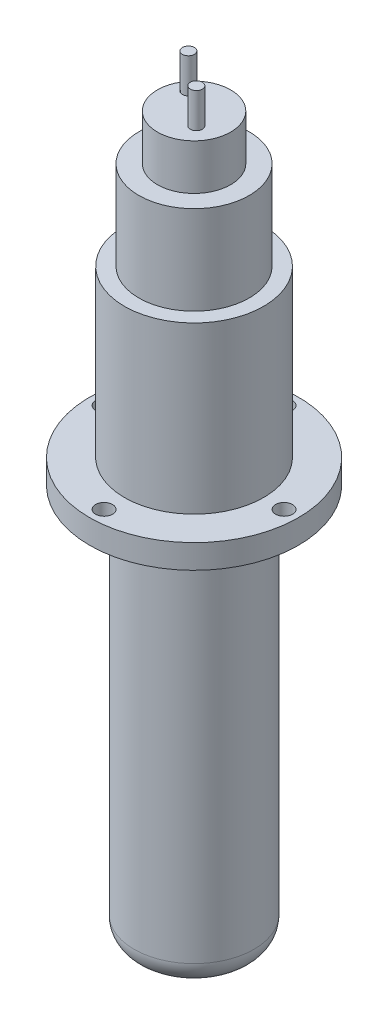
ISO-10303-21;
HEADER;
FILE_DESCRIPTION(('STEP AP214'),'2;1');
FILE_NAME('part.step','',(''),(''),'','','');
FILE_SCHEMA(('AUTOMOTIVE_DESIGN { 1 0 10303 214 1 1 1 1 }'));
ENDSEC;
DATA;
#1=APPLICATION_CONTEXT('core data for automotive mechanical design processes');
#2=APPLICATION_PROTOCOL_DEFINITION('international standard','automotive_design',2000,#1);
#3=PRODUCT_CONTEXT('',#1,'mechanical');
#4=PRODUCT('Part','Part','',(#3));
#5=PRODUCT_RELATED_PRODUCT_CATEGORY('part','',(#4));
#6=PRODUCT_DEFINITION_FORMATION('','',#4);
#7=PRODUCT_DEFINITION_CONTEXT('part definition',#1,'design');
#8=PRODUCT_DEFINITION('design','',#6,#7);
#9=PRODUCT_DEFINITION_SHAPE('','',#8);
#10=(LENGTH_UNIT() NAMED_UNIT(*) SI_UNIT(.MILLI.,.METRE.));
#11=(NAMED_UNIT(*) PLANE_ANGLE_UNIT() SI_UNIT($,.RADIAN.));
#12=(NAMED_UNIT(*) SI_UNIT($,.STERADIAN.) SOLID_ANGLE_UNIT());
#13=UNCERTAINTY_MEASURE_WITH_UNIT(LENGTH_MEASURE(1.E-05),#10,'distance_accuracy_value','');
#14=(GEOMETRIC_REPRESENTATION_CONTEXT(3) GLOBAL_UNCERTAINTY_ASSIGNED_CONTEXT((#13)) GLOBAL_UNIT_ASSIGNED_CONTEXT((#10,
#11,#12)) REPRESENTATION_CONTEXT('',''));
#15=CARTESIAN_POINT('',(0.,0.,0.));
#16=DIRECTION('',(0.,0.,1.));
#17=DIRECTION('',(1.,0.,0.));
#18=AXIS2_PLACEMENT_3D('',#15,#16,#17);
#19=CARTESIAN_POINT('',(0.,5.08,0.));
#20=DIRECTION('',(0.,-1.,0.));
#21=DIRECTION('',(0.,0.,-1.));
#22=AXIS2_PLACEMENT_3D('',#19,#20,#21);
#23=CYLINDRICAL_SURFACE('',#22,22.098);
#24=CARTESIAN_POINT('',(0.,5.08,0.));
#25=DIRECTION('',(0.,1.,0.));
#26=DIRECTION('',(0.,0.,1.));
#27=AXIS2_PLACEMENT_3D('',#24,#25,#26);
#28=CIRCLE('',#27,22.098);
#29=CARTESIAN_POINT('',(0.,5.08,22.098));
#30=VERTEX_POINT('',#29);
#31=EDGE_CURVE('E76',#30,#30,#28,.T.);
#32=ORIENTED_EDGE('',*,*,#31,.F.);
#33=EDGE_LOOP('',(#32));
#34=FACE_BOUND('',#33,.T.);
#35=CARTESIAN_POINT('',(0.,0.,0.));
#36=DIRECTION('',(0.,1.,0.));
#37=DIRECTION('',(0.,0.,1.));
#38=AXIS2_PLACEMENT_3D('',#35,#36,#37);
#39=CIRCLE('',#38,22.098);
#40=CARTESIAN_POINT('',(0.,0.,22.098));
#41=VERTEX_POINT('',#40);
#42=EDGE_CURVE('E73',#41,#41,#39,.T.);
#43=ORIENTED_EDGE('',*,*,#42,.T.);
#44=EDGE_LOOP('',(#43));
#45=FACE_BOUND('',#44,.T.);
#46=ADVANCED_FACE('F40',(#34,#45),#23,.T.);
#47=CARTESIAN_POINT('',(0.,5.08,0.));
#48=DIRECTION('',(0.,1.,0.));
#49=DIRECTION('',(0.,0.,1.));
#50=AXIS2_PLACEMENT_3D('',#47,#48,#49);
#51=PLANE('',#50);
#52=CARTESIAN_POINT('',(-19.05,5.08,0.));
#53=DIRECTION('',(0.,1.,0.));
#54=DIRECTION('',(1.,0.,0.));
#55=AXIS2_PLACEMENT_3D('',#52,#53,#54);
#56=CIRCLE('',#55,1.7907);
#57=CARTESIAN_POINT('',(-17.2593,5.08,0.));
#58=VERTEX_POINT('',#57);
#59=EDGE_CURVE('E68',#58,#58,#56,.T.);
#60=ORIENTED_EDGE('',*,*,#59,.F.);
#61=EDGE_LOOP('',(#60));
#62=FACE_BOUND('',#61,.T.);
#63=CARTESIAN_POINT('',(0.,5.08,19.05));
#64=DIRECTION('',(0.,1.,0.));
#65=DIRECTION('',(0.,0.,-1.));
#66=AXIS2_PLACEMENT_3D('',#63,#64,#65);
#67=CIRCLE('',#66,1.7907);
#68=CARTESIAN_POINT('',(0.,5.08,17.2593));
#69=VERTEX_POINT('',#68);
#70=EDGE_CURVE('E112',#69,#69,#67,.T.);
#71=ORIENTED_EDGE('',*,*,#70,.F.);
#72=EDGE_LOOP('',(#71));
#73=FACE_BOUND('',#72,.T.);
#74=CARTESIAN_POINT('',(19.05,5.08,-1.99538158514885E-13));
#75=DIRECTION('',(0.,1.,0.));
#76=DIRECTION('',(-1.,0.,0.));
#77=AXIS2_PLACEMENT_3D('',#74,#75,#76);
#78=CIRCLE('',#77,1.7907);
#79=CARTESIAN_POINT('',(17.2593,5.08,-1.80781571614486E-13));
#80=VERTEX_POINT('',#79);
#81=EDGE_CURVE('E109',#80,#80,#78,.T.);
#82=ORIENTED_EDGE('',*,*,#81,.F.);
#83=EDGE_LOOP('',(#82));
#84=FACE_BOUND('',#83,.T.);
#85=CARTESIAN_POINT('',(0.,5.08,-19.05));
#86=DIRECTION('',(0.,1.,0.));
#87=DIRECTION('',(0.,0.,1.));
#88=AXIS2_PLACEMENT_3D('',#85,#86,#87);
#89=CIRCLE('',#88,1.7907);
#90=CARTESIAN_POINT('',(0.,5.08,-17.2593));
#91=VERTEX_POINT('',#90);
#92=EDGE_CURVE('E61',#91,#91,#89,.T.);
#93=ORIENTED_EDGE('',*,*,#92,.F.);
#94=EDGE_LOOP('',(#93));
#95=FACE_BOUND('',#94,.T.);
#96=CARTESIAN_POINT('',(0.,5.08,0.));
#97=DIRECTION('',(0.,1.,0.));
#98=DIRECTION('',(0.,0.,1.));
#99=AXIS2_PLACEMENT_3D('',#96,#97,#98);
#100=CIRCLE('',#99,14.732);
#101=CARTESIAN_POINT('',(0.,5.08,14.732));
#102=VERTEX_POINT('',#101);
#103=EDGE_CURVE('E80',#102,#102,#100,.T.);
#104=ORIENTED_EDGE('',*,*,#103,.F.);
#105=EDGE_LOOP('',(#104));
#106=FACE_BOUND('',#105,.T.);
#107=ORIENTED_EDGE('',*,*,#31,.T.);
#108=EDGE_LOOP('',(#107));
#109=FACE_BOUND('',#108,.T.);
#110=ADVANCED_FACE('F121',(#62,#73,#84,#95,#106,#109),#51,.T.);
#111=CARTESIAN_POINT('',(0.,0.,0.));
#112=DIRECTION('',(0.,1.,0.));
#113=DIRECTION('',(0.,0.,1.));
#114=AXIS2_PLACEMENT_3D('',#111,#112,#113);
#115=PLANE('',#114);
#116=CARTESIAN_POINT('',(0.,0.,0.));
#117=DIRECTION('',(0.,1.,0.));
#118=DIRECTION('',(0.,0.,1.));
#119=AXIS2_PLACEMENT_3D('',#116,#117,#118);
#120=CIRCLE('',#119,12.7);
#121=CARTESIAN_POINT('',(0.,0.,12.7));
#122=VERTEX_POINT('',#121);
#123=EDGE_CURVE('E51',#122,#122,#120,.F.);
#124=ORIENTED_EDGE('',*,*,#123,.F.);
#125=EDGE_LOOP('',(#124));
#126=FACE_BOUND('',#125,.T.);
#127=CARTESIAN_POINT('',(-19.05,0.,0.));
#128=DIRECTION('',(0.,1.,0.));
#129=DIRECTION('',(0.,0.,1.));
#130=AXIS2_PLACEMENT_3D('',#127,#128,#129);
#131=CIRCLE('',#130,1.7907);
#132=CARTESIAN_POINT('',(-19.05,0.,1.79070000000007));
#133=VERTEX_POINT('',#132);
#134=EDGE_CURVE('E58',#133,#133,#131,.T.);
#135=ORIENTED_EDGE('',*,*,#134,.T.);
#136=EDGE_LOOP('',(#135));
#137=FACE_BOUND('',#136,.T.);
#138=CARTESIAN_POINT('',(0.,0.,19.05));
#139=DIRECTION('',(0.,1.,0.));
#140=DIRECTION('',(0.,0.,1.));
#141=AXIS2_PLACEMENT_3D('',#138,#139,#140);
#142=CIRCLE('',#141,1.7907);
#143=CARTESIAN_POINT('',(0.,0.,20.8407));
#144=VERTEX_POINT('',#143);
#145=EDGE_CURVE('E62',#144,#144,#142,.T.);
#146=ORIENTED_EDGE('',*,*,#145,.T.);
#147=EDGE_LOOP('',(#146));
#148=FACE_BOUND('',#147,.T.);
#149=CARTESIAN_POINT('',(19.05,0.,-1.99538158514885E-13));
#150=DIRECTION('',(0.,1.,0.));
#151=DIRECTION('',(0.,0.,1.));
#152=AXIS2_PLACEMENT_3D('',#149,#150,#151);
#153=CIRCLE('',#152,1.7907);
#154=CARTESIAN_POINT('',(19.05,0.,1.7906999999998));
#155=VERTEX_POINT('',#154);
#156=EDGE_CURVE('E65',#155,#155,#153,.T.);
#157=ORIENTED_EDGE('',*,*,#156,.T.);
#158=EDGE_LOOP('',(#157));
#159=FACE_BOUND('',#158,.T.);
#160=CARTESIAN_POINT('',(0.,0.,-19.05));
#161=DIRECTION('',(0.,1.,0.));
#162=DIRECTION('',(0.,0.,1.));
#163=AXIS2_PLACEMENT_3D('',#160,#161,#162);
#164=CIRCLE('',#163,1.7907);
#165=CARTESIAN_POINT('',(0.,0.,-17.2593));
#166=VERTEX_POINT('',#165);
#167=EDGE_CURVE('E69',#166,#166,#164,.T.);
#168=ORIENTED_EDGE('',*,*,#167,.T.);
#169=EDGE_LOOP('',(#168));
#170=FACE_BOUND('',#169,.T.);
#171=ORIENTED_EDGE('',*,*,#42,.F.);
#172=EDGE_LOOP('',(#171));
#173=FACE_BOUND('',#172,.T.);
#174=ADVANCED_FACE('F124',(#126,#137,#148,#159,#170,#173),#115,.F.);
#175=CARTESIAN_POINT('',(0.,40.132,0.));
#176=DIRECTION('',(0.,-1.,0.));
#177=DIRECTION('',(0.,0.,-1.));
#178=AXIS2_PLACEMENT_3D('',#175,#176,#177);
#179=CYLINDRICAL_SURFACE('',#178,14.732);
#180=CARTESIAN_POINT('',(0.,40.132,0.));
#181=DIRECTION('',(0.,1.,0.));
#182=DIRECTION('',(0.,0.,1.));
#183=AXIS2_PLACEMENT_3D('',#180,#181,#182);
#184=CIRCLE('',#183,14.732);
#185=CARTESIAN_POINT('',(0.,40.132,14.732));
#186=VERTEX_POINT('',#185);
#187=EDGE_CURVE('E77',#186,#186,#184,.T.);
#188=ORIENTED_EDGE('',*,*,#187,.F.);
#189=EDGE_LOOP('',(#188));
#190=FACE_BOUND('',#189,.T.);
#191=ORIENTED_EDGE('',*,*,#103,.T.);
#192=EDGE_LOOP('',(#191));
#193=FACE_BOUND('',#192,.T.);
#194=ADVANCED_FACE('F141',(#190,#193),#179,.T.);
#195=CARTESIAN_POINT('',(0.,40.132,0.));
#196=DIRECTION('',(0.,1.,0.));
#197=DIRECTION('',(0.,0.,1.));
#198=AXIS2_PLACEMENT_3D('',#195,#196,#197);
#199=PLANE('',#198);
#200=CARTESIAN_POINT('',(0.,40.132,0.));
#201=DIRECTION('',(0.,1.,0.));
#202=DIRECTION('',(0.,0.,1.));
#203=AXIS2_PLACEMENT_3D('',#200,#201,#202);
#204=CIRCLE('',#203,11.684);
#205=CARTESIAN_POINT('',(0.,40.132,11.684));
#206=VERTEX_POINT('',#205);
#207=EDGE_CURVE('E83',#206,#206,#204,.T.);
#208=ORIENTED_EDGE('',*,*,#207,.F.);
#209=EDGE_LOOP('',(#208));
#210=FACE_BOUND('',#209,.T.);
#211=ORIENTED_EDGE('',*,*,#187,.T.);
#212=EDGE_LOOP('',(#211));
#213=FACE_BOUND('',#212,.T.);
#214=ADVANCED_FACE('F147',(#210,#213),#199,.T.);
#215=CARTESIAN_POINT('',(0.,58.928,0.));
#216=DIRECTION('',(0.,-1.,0.));
#217=DIRECTION('',(0.,0.,-1.));
#218=AXIS2_PLACEMENT_3D('',#215,#216,#217);
#219=CYLINDRICAL_SURFACE('',#218,11.684);
#220=CARTESIAN_POINT('',(0.,58.928,0.));
#221=DIRECTION('',(0.,1.,0.));
#222=DIRECTION('',(0.,0.,1.));
#223=AXIS2_PLACEMENT_3D('',#220,#221,#222);
#224=CIRCLE('',#223,11.684);
#225=CARTESIAN_POINT('',(0.,58.928,11.684));
#226=VERTEX_POINT('',#225);
#227=EDGE_CURVE('E86',#226,#226,#224,.T.);
#228=ORIENTED_EDGE('',*,*,#227,.F.);
#229=EDGE_LOOP('',(#228));
#230=FACE_BOUND('',#229,.T.);
#231=ORIENTED_EDGE('',*,*,#207,.T.);
#232=EDGE_LOOP('',(#231));
#233=FACE_BOUND('',#232,.T.);
#234=ADVANCED_FACE('F155',(#230,#233),#219,.T.);
#235=CARTESIAN_POINT('',(0.,58.928,0.));
#236=DIRECTION('',(0.,1.,0.));
#237=DIRECTION('',(0.,0.,1.));
#238=AXIS2_PLACEMENT_3D('',#235,#236,#237);
#239=PLANE('',#238);
#240=CARTESIAN_POINT('',(0.,58.928,0.));
#241=DIRECTION('',(0.,1.,0.));
#242=DIRECTION('',(0.,0.,1.));
#243=AXIS2_PLACEMENT_3D('',#240,#241,#242);
#244=CIRCLE('',#243,7.747);
#245=CARTESIAN_POINT('',(0.,58.928,7.747));
#246=VERTEX_POINT('',#245);
#247=EDGE_CURVE('E55',#246,#246,#244,.T.);
#248=ORIENTED_EDGE('',*,*,#247,.F.);
#249=EDGE_LOOP('',(#248));
#250=FACE_BOUND('',#249,.T.);
#251=ORIENTED_EDGE('',*,*,#227,.T.);
#252=EDGE_LOOP('',(#251));
#253=FACE_BOUND('',#252,.T.);
#254=ADVANCED_FACE('F159',(#250,#253),#239,.T.);
#255=CARTESIAN_POINT('',(0.,68.58,0.));
#256=DIRECTION('',(0.,-1.,0.));
#257=DIRECTION('',(0.,0.,-1.));
#258=AXIS2_PLACEMENT_3D('',#255,#256,#257);
#259=CYLINDRICAL_SURFACE('',#258,7.747);
#260=CARTESIAN_POINT('',(0.,68.58,0.));
#261=DIRECTION('',(0.,1.,0.));
#262=DIRECTION('',(0.,0.,1.));
#263=AXIS2_PLACEMENT_3D('',#260,#261,#262);
#264=CIRCLE('',#263,7.747);
#265=CARTESIAN_POINT('',(0.,68.58,7.747));
#266=VERTEX_POINT('',#265);
#267=EDGE_CURVE('E91',#266,#266,#264,.T.);
#268=ORIENTED_EDGE('',*,*,#267,.F.);
#269=EDGE_LOOP('',(#268));
#270=FACE_BOUND('',#269,.T.);
#271=ORIENTED_EDGE('',*,*,#247,.T.);
#272=EDGE_LOOP('',(#271));
#273=FACE_BOUND('',#272,.T.);
#274=ADVANCED_FACE('F163',(#270,#273),#259,.T.);
#275=CARTESIAN_POINT('',(0.,68.58,0.));
#276=DIRECTION('',(0.,1.,0.));
#277=DIRECTION('',(0.,0.,1.));
#278=AXIS2_PLACEMENT_3D('',#275,#276,#277);
#279=PLANE('',#278);
#280=CARTESIAN_POINT('',(2.97002677292824,68.58,2.48175750236612));
#281=DIRECTION('',(0.,1.,0.));
#282=DIRECTION('',(0.,0.,1.));
#283=AXIS2_PLACEMENT_3D('',#280,#281,#282);
#284=CIRCLE('',#283,1.27);
#285=CARTESIAN_POINT('',(2.97002677292824,68.58,3.75175750236612));
#286=VERTEX_POINT('',#285);
#287=EDGE_CURVE('E72',#286,#286,#284,.T.);
#288=ORIENTED_EDGE('',*,*,#287,.F.);
#289=EDGE_LOOP('',(#288));
#290=FACE_BOUND('',#289,.T.);
#291=CARTESIAN_POINT('',(-4.24340631789732,68.58,-3.04439882199858));
#292=DIRECTION('',(0.,1.,0.));
#293=DIRECTION('',(0.,0.,1.));
#294=AXIS2_PLACEMENT_3D('',#291,#292,#293);
#295=CIRCLE('',#294,1.27);
#296=CARTESIAN_POINT('',(-4.24340631789732,68.58,-1.77439882199858));
#297=VERTEX_POINT('',#296);
#298=EDGE_CURVE('E97',#297,#297,#295,.T.);
#299=ORIENTED_EDGE('',*,*,#298,.F.);
#300=EDGE_LOOP('',(#299));
#301=FACE_BOUND('',#300,.T.);
#302=ORIENTED_EDGE('',*,*,#267,.T.);
#303=EDGE_LOOP('',(#302));
#304=FACE_BOUND('',#303,.T.);
#305=ADVANCED_FACE('F167',(#290,#301,#304),#279,.T.);
#306=CARTESIAN_POINT('',(-4.24340631789732,75.946,-3.04439882199858));
#307=DIRECTION('',(0.,-1.,0.));
#308=DIRECTION('',(0.,0.,-1.));
#309=AXIS2_PLACEMENT_3D('',#306,#307,#308);
#310=CYLINDRICAL_SURFACE('',#309,1.27);
#311=CARTESIAN_POINT('',(-4.24340631789732,75.946,-3.04439882199858));
#312=DIRECTION('',(0.,1.,0.));
#313=DIRECTION('',(0.,0.,1.));
#314=AXIS2_PLACEMENT_3D('',#311,#312,#313);
#315=CIRCLE('',#314,1.27);
#316=CARTESIAN_POINT('',(-4.24340631789732,75.946,-1.77439882199858));
#317=VERTEX_POINT('',#316);
#318=EDGE_CURVE('E96',#317,#317,#315,.T.);
#319=ORIENTED_EDGE('',*,*,#318,.F.);
#320=EDGE_LOOP('',(#319));
#321=FACE_BOUND('',#320,.T.);
#322=ORIENTED_EDGE('',*,*,#298,.T.);
#323=EDGE_LOOP('',(#322));
#324=FACE_BOUND('',#323,.T.);
#325=ADVANCED_FACE('F171',(#321,#324),#310,.T.);
#326=CARTESIAN_POINT('',(-4.24340631789732,75.946,-3.04439882199858));
#327=DIRECTION('',(0.,1.,0.));
#328=DIRECTION('',(0.,0.,1.));
#329=AXIS2_PLACEMENT_3D('',#326,#327,#328);
#330=PLANE('',#329);
#331=ORIENTED_EDGE('',*,*,#318,.T.);
#332=EDGE_LOOP('',(#331));
#333=FACE_BOUND('',#332,.T.);
#334=ADVANCED_FACE('F175',(#333),#330,.T.);
#335=CARTESIAN_POINT('',(2.97002677292824,75.946,2.48175750236612));
#336=DIRECTION('',(0.,-1.,0.));
#337=DIRECTION('',(0.,0.,-1.));
#338=AXIS2_PLACEMENT_3D('',#335,#336,#337);
#339=CYLINDRICAL_SURFACE('',#338,1.27);
#340=CARTESIAN_POINT('',(2.97002677292824,75.946,2.48175750236612));
#341=DIRECTION('',(0.,1.,0.));
#342=DIRECTION('',(0.,0.,1.));
#343=AXIS2_PLACEMENT_3D('',#340,#341,#342);
#344=CIRCLE('',#343,1.27);
#345=CARTESIAN_POINT('',(2.97002677292824,75.946,3.75175750236612));
#346=VERTEX_POINT('',#345);
#347=EDGE_CURVE('E100',#346,#346,#344,.T.);
#348=ORIENTED_EDGE('',*,*,#347,.F.);
#349=EDGE_LOOP('',(#348));
#350=FACE_BOUND('',#349,.T.);
#351=ORIENTED_EDGE('',*,*,#287,.T.);
#352=EDGE_LOOP('',(#351));
#353=FACE_BOUND('',#352,.T.);
#354=ADVANCED_FACE('F179',(#350,#353),#339,.T.);
#355=CARTESIAN_POINT('',(2.97002677292824,75.946,2.48175750236612));
#356=DIRECTION('',(0.,1.,0.));
#357=DIRECTION('',(0.,0.,1.));
#358=AXIS2_PLACEMENT_3D('',#355,#356,#357);
#359=PLANE('',#358);
#360=ORIENTED_EDGE('',*,*,#347,.T.);
#361=EDGE_LOOP('',(#360));
#362=FACE_BOUND('',#361,.T.);
#363=ADVANCED_FACE('F183',(#362),#359,.T.);
#364=CARTESIAN_POINT('',(0.,-2.286,-19.05));
#365=DIRECTION('',(0.,1.,0.));
#366=DIRECTION('',(0.,0.,1.));
#367=AXIS2_PLACEMENT_3D('',#364,#365,#366);
#368=CYLINDRICAL_SURFACE('',#367,1.7907);
#369=ORIENTED_EDGE('',*,*,#92,.T.);
#370=EDGE_LOOP('',(#369));
#371=FACE_BOUND('',#370,.T.);
#372=ORIENTED_EDGE('',*,*,#167,.F.);
#373=EDGE_LOOP('',(#372));
#374=FACE_BOUND('',#373,.T.);
#375=ADVANCED_FACE('F187',(#371,#374),#368,.F.);
#376=CARTESIAN_POINT('',(19.05,-2.286,-1.99538158514885E-13));
#377=DIRECTION('',(0.,1.,0.));
#378=DIRECTION('',(0.,0.,1.));
#379=AXIS2_PLACEMENT_3D('',#376,#377,#378);
#380=CYLINDRICAL_SURFACE('',#379,1.7907);
#381=ORIENTED_EDGE('',*,*,#81,.T.);
#382=EDGE_LOOP('',(#381));
#383=FACE_BOUND('',#382,.T.);
#384=ORIENTED_EDGE('',*,*,#156,.F.);
#385=EDGE_LOOP('',(#384));
#386=FACE_BOUND('',#385,.T.);
#387=ADVANCED_FACE('F191',(#383,#386),#380,.F.);
#388=CARTESIAN_POINT('',(0.,-2.286,19.05));
#389=DIRECTION('',(0.,1.,0.));
#390=DIRECTION('',(0.,0.,1.));
#391=AXIS2_PLACEMENT_3D('',#388,#389,#390);
#392=CYLINDRICAL_SURFACE('',#391,1.7907);
#393=ORIENTED_EDGE('',*,*,#70,.T.);
#394=EDGE_LOOP('',(#393));
#395=FACE_BOUND('',#394,.T.);
#396=ORIENTED_EDGE('',*,*,#145,.F.);
#397=EDGE_LOOP('',(#396));
#398=FACE_BOUND('',#397,.T.);
#399=ADVANCED_FACE('F195',(#395,#398),#392,.F.);
#400=CARTESIAN_POINT('',(-19.05,-2.286,0.));
#401=DIRECTION('',(0.,1.,0.));
#402=DIRECTION('',(0.,0.,1.));
#403=AXIS2_PLACEMENT_3D('',#400,#401,#402);
#404=CYLINDRICAL_SURFACE('',#403,1.7907);
#405=ORIENTED_EDGE('',*,*,#59,.T.);
#406=EDGE_LOOP('',(#405));
#407=FACE_BOUND('',#406,.T.);
#408=ORIENTED_EDGE('',*,*,#134,.F.);
#409=EDGE_LOOP('',(#408));
#410=FACE_BOUND('',#409,.T.);
#411=ADVANCED_FACE('F118',(#407,#410),#404,.F.);
#412=CARTESIAN_POINT('',(0.,-83.82,0.));
#413=DIRECTION('',(0.,1.,0.));
#414=DIRECTION('',(0.,0.,1.));
#415=AXIS2_PLACEMENT_3D('',#412,#413,#414);
#416=CYLINDRICAL_SURFACE('',#415,12.7);
#417=CARTESIAN_POINT('',(0.,-78.74,0.));
#418=DIRECTION('',(0.,-1.,0.));
#419=DIRECTION('',(0.,0.,-1.));
#420=AXIS2_PLACEMENT_3D('',#417,#418,#419);
#421=CIRCLE('',#420,12.7);
#422=CARTESIAN_POINT('',(0.,-78.74,-12.7));
#423=VERTEX_POINT('',#422);
#424=EDGE_CURVE('E10',#423,#423,#421,.F.);
#425=ORIENTED_EDGE('',*,*,#424,.T.);
#426=EDGE_LOOP('',(#425));
#427=FACE_BOUND('',#426,.T.);
#428=ORIENTED_EDGE('',*,*,#123,.T.);
#429=EDGE_LOOP('',(#428));
#430=FACE_BOUND('',#429,.T.);
#431=ADVANCED_FACE('F202',(#427,#430),#416,.T.);
#432=CARTESIAN_POINT('',(0.,-83.82,0.));
#433=DIRECTION('',(0.,-1.,0.));
#434=DIRECTION('',(0.,0.,-1.));
#435=AXIS2_PLACEMENT_3D('',#432,#433,#434);
#436=PLANE('',#435);
#437=CARTESIAN_POINT('',(0.,-83.82,0.));
#438=DIRECTION('',(0.,-1.,0.));
#439=DIRECTION('',(0.,0.,-1.));
#440=AXIS2_PLACEMENT_3D('',#437,#438,#439);
#441=CIRCLE('',#440,7.62);
#442=CARTESIAN_POINT('',(0.,-83.82,-7.62));
#443=VERTEX_POINT('',#442);
#444=EDGE_CURVE('E47',#443,#443,#441,.T.);
#445=ORIENTED_EDGE('',*,*,#444,.T.);
#446=EDGE_LOOP('',(#445));
#447=FACE_BOUND('',#446,.T.);
#448=ADVANCED_FACE('F205',(#447),#436,.T.);
#449=CARTESIAN_POINT('',(0.,-78.74,0.));
#450=DIRECTION('',(0.,-1.,0.));
#451=DIRECTION('',(0.,0.,-1.));
#452=AXIS2_PLACEMENT_3D('',#449,#450,#451);
#453=TOROIDAL_SURFACE('',#452,7.62,5.08);
#454=ORIENTED_EDGE('',*,*,#424,.F.);
#455=EDGE_LOOP('',(#454));
#456=FACE_BOUND('',#455,.T.);
#457=ORIENTED_EDGE('',*,*,#444,.F.);
#458=EDGE_LOOP('',(#457));
#459=FACE_BOUND('',#458,.T.);
#460=ADVANCED_FACE('F42',(#456,#459),#453,.T.);
#461=CLOSED_SHELL('',(#46,#110,#174,#194,#214,#234,#254,#274,#305,#325,#334,#354,#363,#375,#387,
#399,#411,#431,#448,#460));
#462=MANIFOLD_SOLID_BREP('B2',#461);
#463=ADVANCED_BREP_SHAPE_REPRESENTATION('',(#18,#462),#14);
#464=SHAPE_DEFINITION_REPRESENTATION(#9,#463);
ENDSEC;
END-ISO-10303-21;
